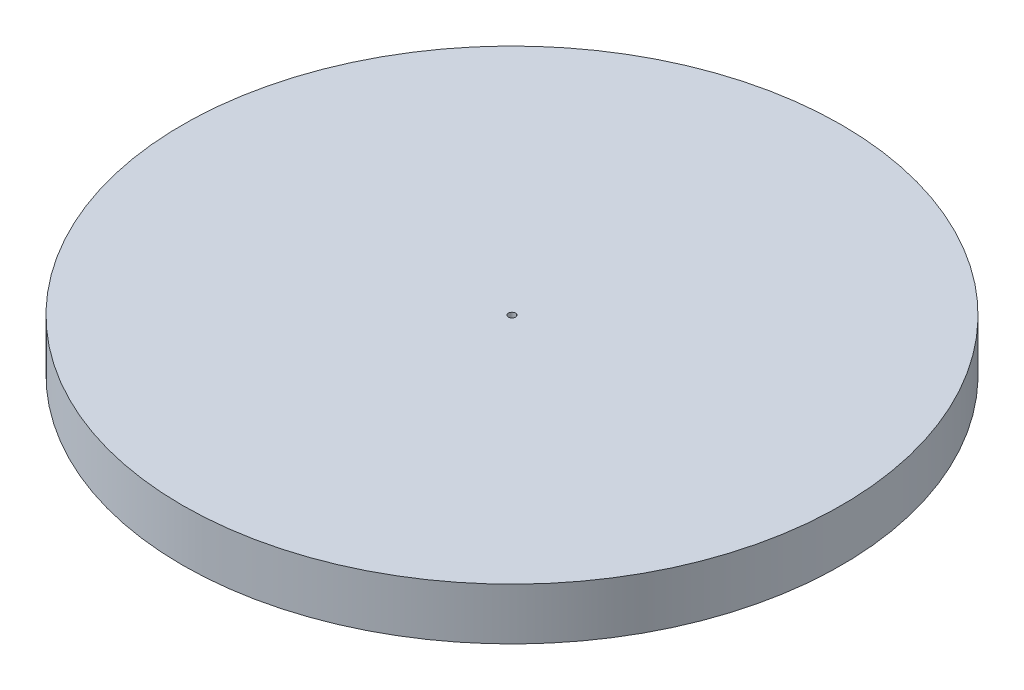
ISO-10303-21;
HEADER;
FILE_DESCRIPTION(('STEP AP214'),'2;1');
FILE_NAME('part.step','',(''),(''),'','','');
FILE_SCHEMA(('AUTOMOTIVE_DESIGN { 1 0 10303 214 1 1 1 1 }'));
ENDSEC;
DATA;
#1=APPLICATION_CONTEXT('core data for automotive mechanical design processes');
#2=APPLICATION_PROTOCOL_DEFINITION('international standard','automotive_design',2000,#1);
#3=PRODUCT_CONTEXT('',#1,'mechanical');
#4=PRODUCT('Part','Part','',(#3));
#5=PRODUCT_RELATED_PRODUCT_CATEGORY('part','',(#4));
#6=PRODUCT_DEFINITION_FORMATION('','',#4);
#7=PRODUCT_DEFINITION_CONTEXT('part definition',#1,'design');
#8=PRODUCT_DEFINITION('design','',#6,#7);
#9=PRODUCT_DEFINITION_SHAPE('','',#8);
#10=(LENGTH_UNIT() NAMED_UNIT(*) SI_UNIT(.MILLI.,.METRE.));
#11=(NAMED_UNIT(*) PLANE_ANGLE_UNIT() SI_UNIT($,.RADIAN.));
#12=(NAMED_UNIT(*) SI_UNIT($,.STERADIAN.) SOLID_ANGLE_UNIT());
#13=UNCERTAINTY_MEASURE_WITH_UNIT(LENGTH_MEASURE(1.E-05),#10,'distance_accuracy_value','');
#14=(GEOMETRIC_REPRESENTATION_CONTEXT(3) GLOBAL_UNCERTAINTY_ASSIGNED_CONTEXT((#13)) GLOBAL_UNIT_ASSIGNED_CONTEXT((#10,
#11,#12)) REPRESENTATION_CONTEXT('',''));
#15=CARTESIAN_POINT('',(0.,0.,0.));
#16=DIRECTION('',(0.,0.,1.));
#17=DIRECTION('',(1.,0.,0.));
#18=AXIS2_PLACEMENT_3D('',#15,#16,#17);
#19=CARTESIAN_POINT('',(0.,11.,0.));
#20=DIRECTION('',(0.,-1.,0.));
#21=DIRECTION('',(0.,0.,-1.));
#22=AXIS2_PLACEMENT_3D('',#19,#20,#21);
#23=CYLINDRICAL_SURFACE('',#22,70.);
#24=CARTESIAN_POINT('',(0.,11.,0.));
#25=DIRECTION('',(0.,1.,0.));
#26=DIRECTION('',(0.,0.,1.));
#27=AXIS2_PLACEMENT_3D('',#24,#25,#26);
#28=CIRCLE('',#27,70.);
#29=CARTESIAN_POINT('',(0.,11.,70.));
#30=VERTEX_POINT('',#29);
#31=EDGE_CURVE('E10',#30,#30,#28,.T.);
#32=ORIENTED_EDGE('',*,*,#31,.F.);
#33=EDGE_LOOP('',(#32));
#34=FACE_BOUND('',#33,.T.);
#35=CARTESIAN_POINT('',(0.,0.,0.));
#36=DIRECTION('',(0.,1.,0.));
#37=DIRECTION('',(0.,0.,1.));
#38=AXIS2_PLACEMENT_3D('',#35,#36,#37);
#39=CIRCLE('',#38,70.);
#40=CARTESIAN_POINT('',(0.,0.,70.));
#41=VERTEX_POINT('',#40);
#42=EDGE_CURVE('E35',#41,#41,#39,.T.);
#43=ORIENTED_EDGE('',*,*,#42,.T.);
#44=EDGE_LOOP('',(#43));
#45=FACE_BOUND('',#44,.T.);
#46=ADVANCED_FACE('F32',(#34,#45),#23,.T.);
#47=CARTESIAN_POINT('',(0.,11.,0.));
#48=DIRECTION('',(0.,1.,0.));
#49=DIRECTION('',(0.,0.,1.));
#50=AXIS2_PLACEMENT_3D('',#47,#48,#49);
#51=PLANE('',#50);
#52=CARTESIAN_POINT('',(0.,11.,0.));
#53=DIRECTION('',(0.,1.,0.));
#54=DIRECTION('',(0.,0.,1.));
#55=AXIS2_PLACEMENT_3D('',#52,#53,#54);
#56=CIRCLE('',#55,0.75);
#57=CARTESIAN_POINT('',(0.,11.,0.75));
#58=VERTEX_POINT('',#57);
#59=EDGE_CURVE('E46',#58,#58,#56,.T.);
#60=ORIENTED_EDGE('',*,*,#59,.F.);
#61=EDGE_LOOP('',(#60));
#62=FACE_BOUND('',#61,.T.);
#63=ORIENTED_EDGE('',*,*,#31,.T.);
#64=EDGE_LOOP('',(#63));
#65=FACE_BOUND('',#64,.T.);
#66=ADVANCED_FACE('F53',(#62,#65),#51,.T.);
#67=CARTESIAN_POINT('',(0.,0.,0.));
#68=DIRECTION('',(0.,1.,0.));
#69=DIRECTION('',(0.,0.,1.));
#70=AXIS2_PLACEMENT_3D('',#67,#68,#69);
#71=PLANE('',#70);
#72=CARTESIAN_POINT('',(0.,0.,0.));
#73=DIRECTION('',(0.,1.,0.));
#74=DIRECTION('',(0.,0.,1.));
#75=AXIS2_PLACEMENT_3D('',#72,#73,#74);
#76=CIRCLE('',#75,0.75);
#77=CARTESIAN_POINT('',(0.,0.,0.75));
#78=VERTEX_POINT('',#77);
#79=EDGE_CURVE('E42',#78,#78,#76,.F.);
#80=ORIENTED_EDGE('',*,*,#79,.F.);
#81=EDGE_LOOP('',(#80));
#82=FACE_BOUND('',#81,.T.);
#83=ORIENTED_EDGE('',*,*,#42,.F.);
#84=EDGE_LOOP('',(#83));
#85=FACE_BOUND('',#84,.T.);
#86=ADVANCED_FACE('F55',(#82,#85),#71,.F.);
#87=CARTESIAN_POINT('',(0.,-0.000999999999999265,0.));
#88=DIRECTION('',(0.,1.,0.));
#89=DIRECTION('',(0.,0.,1.));
#90=AXIS2_PLACEMENT_3D('',#87,#88,#89);
#91=CYLINDRICAL_SURFACE('',#90,0.75);
#92=ORIENTED_EDGE('',*,*,#59,.T.);
#93=EDGE_LOOP('',(#92));
#94=FACE_BOUND('',#93,.T.);
#95=ORIENTED_EDGE('',*,*,#79,.T.);
#96=EDGE_LOOP('',(#95));
#97=FACE_BOUND('',#96,.T.);
#98=ADVANCED_FACE('F50',(#94,#97),#91,.F.);
#99=CLOSED_SHELL('',(#46,#66,#86,#98));
#100=MANIFOLD_SOLID_BREP('B2',#99);
#101=ADVANCED_BREP_SHAPE_REPRESENTATION('',(#18,#100),#14);
#102=SHAPE_DEFINITION_REPRESENTATION(#9,#101);
ENDSEC;
END-ISO-10303-21;
